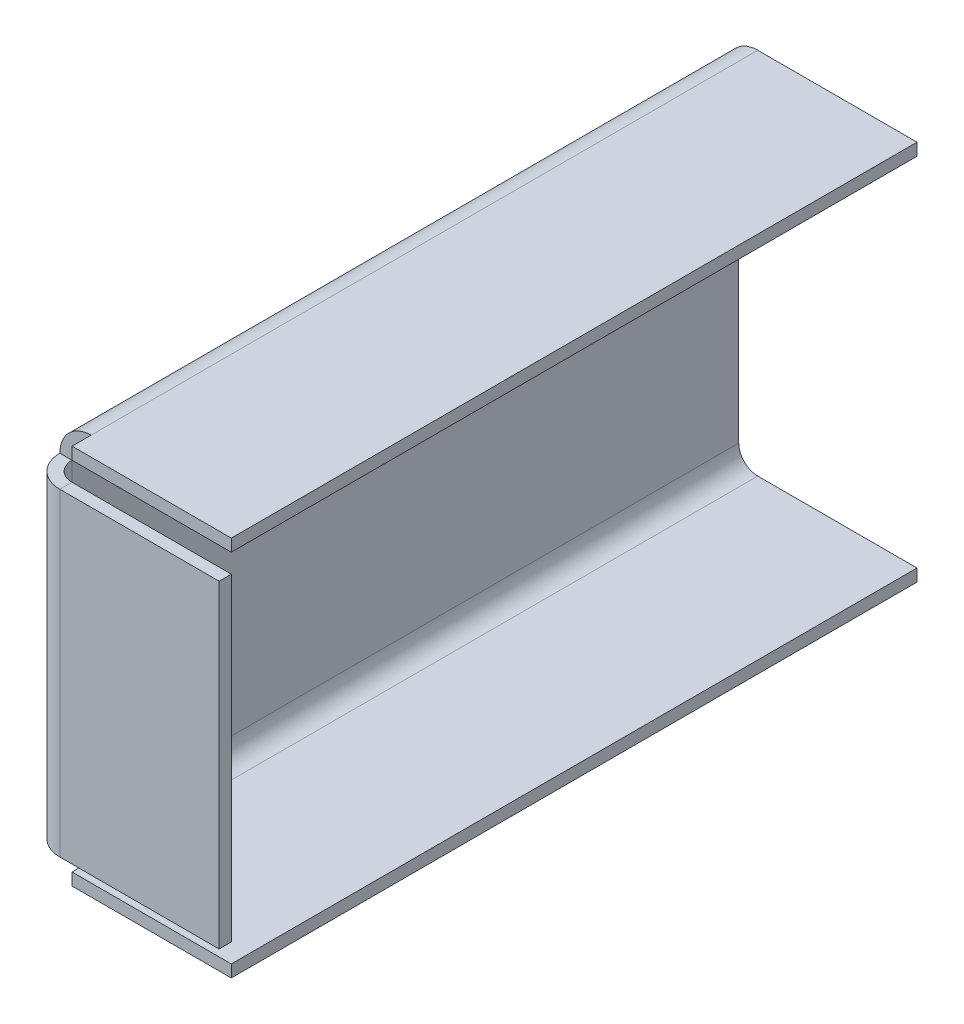
ISO-10303-21;
HEADER;
FILE_DESCRIPTION(('STEP AP214'),'2;1');
FILE_NAME('part.step','',(''),(''),'','','');
FILE_SCHEMA(('AUTOMOTIVE_DESIGN { 1 0 10303 214 1 1 1 1 }'));
ENDSEC;
DATA;
#1=APPLICATION_CONTEXT('core data for automotive mechanical design processes');
#2=APPLICATION_PROTOCOL_DEFINITION('international standard','automotive_design',2000,#1);
#3=PRODUCT_CONTEXT('',#1,'mechanical');
#4=PRODUCT('Part','Part','',(#3));
#5=PRODUCT_RELATED_PRODUCT_CATEGORY('part','',(#4));
#6=PRODUCT_DEFINITION_FORMATION('','',#4);
#7=PRODUCT_DEFINITION_CONTEXT('part definition',#1,'design');
#8=PRODUCT_DEFINITION('design','',#6,#7);
#9=PRODUCT_DEFINITION_SHAPE('','',#8);
#10=(LENGTH_UNIT() NAMED_UNIT(*) SI_UNIT(.MILLI.,.METRE.));
#11=(NAMED_UNIT(*) PLANE_ANGLE_UNIT() SI_UNIT($,.RADIAN.));
#12=(NAMED_UNIT(*) SI_UNIT($,.STERADIAN.) SOLID_ANGLE_UNIT());
#13=UNCERTAINTY_MEASURE_WITH_UNIT(LENGTH_MEASURE(1.E-05),#10,'distance_accuracy_value','');
#14=(GEOMETRIC_REPRESENTATION_CONTEXT(3) GLOBAL_UNCERTAINTY_ASSIGNED_CONTEXT((#13)) GLOBAL_UNIT_ASSIGNED_CONTEXT((#10,
#11,#12)) REPRESENTATION_CONTEXT('',''));
#15=CARTESIAN_POINT('',(0.,0.,0.));
#16=DIRECTION('',(0.,0.,1.));
#17=DIRECTION('',(1.,0.,0.));
#18=AXIS2_PLACEMENT_3D('',#15,#16,#17);
#19=CARTESIAN_POINT('',(3.17499999999998,0.,0.));
#20=DIRECTION('',(-1.,0.,0.));
#21=DIRECTION('',(0.,-1.,0.));
#22=AXIS2_PLACEMENT_3D('',#19,#20,#21);
#23=PLANE('',#22);
#24=DIRECTION('',(0.,1.,0.));
#25=VECTOR('',#24,1.);
#26=CARTESIAN_POINT('',(3.17499999999998,0.,-3.17499999999998));
#27=LINE('',#26,#25);
#28=CARTESIAN_POINT('',(3.17499999999998,0.,-3.17499999999998));
#29=VERTEX_POINT('',#28);
#30=CARTESIAN_POINT('',(3.17499999999999,2.03199999999999,-3.17499999999998));
#31=VERTEX_POINT('',#30);
#32=EDGE_CURVE('E13',#29,#31,#27,.T.);
#33=ORIENTED_EDGE('',*,*,#32,.F.);
#34=DIRECTION('',(0.,0.,-1.));
#35=VECTOR('',#34,1.);
#36=CARTESIAN_POINT('',(3.17499999999998,0.,0.));
#37=LINE('',#36,#35);
#38=CARTESIAN_POINT('',(3.17499999999998,0.,0.));
#39=VERTEX_POINT('',#38);
#40=EDGE_CURVE('E295',#29,#39,#37,.F.);
#41=ORIENTED_EDGE('',*,*,#40,.T.);
#42=DIRECTION('',(0.,1.,0.));
#43=VECTOR('',#42,1.);
#44=CARTESIAN_POINT('',(3.17499999999998,0.,0.));
#45=LINE('',#44,#43);
#46=CARTESIAN_POINT('',(3.17499999999999,2.03199999999999,0.));
#47=VERTEX_POINT('',#46);
#48=EDGE_CURVE('E268',#47,#39,#45,.F.);
#49=ORIENTED_EDGE('',*,*,#48,.F.);
#50=DIRECTION('',(0.,0.,-1.));
#51=VECTOR('',#50,1.);
#52=CARTESIAN_POINT('',(3.17499999999999,2.03199999999999,0.));
#53=LINE('',#52,#51);
#54=EDGE_CURVE('E299',#47,#31,#53,.T.);
#55=ORIENTED_EDGE('',*,*,#54,.T.);
#56=EDGE_LOOP('',(#33,#41,#49,#55));
#57=FACE_BOUND('',#56,.T.);
#58=ADVANCED_FACE('F85',(#57),#23,.T.);
#59=CARTESIAN_POINT('',(3.175,5.20699999999998,-114.3));
#60=DIRECTION('',(0.,0.,-1.));
#61=DIRECTION('',(0.,-1.,0.));
#62=AXIS2_PLACEMENT_3D('',#59,#60,#61);
#63=CYLINDRICAL_SURFACE('',#62,5.20700000000001);
#64=CARTESIAN_POINT('',(3.17499999999998,0.,-114.3));
#65=VERTEX_POINT('',#64);
#66=EDGE_CURVE('E292',#65,#29,#37,.F.);
#67=ORIENTED_EDGE('',*,*,#66,.T.);
#68=CARTESIAN_POINT('',(3.175,5.207,-3.17499999999998));
#69=DIRECTION('',(0.,0.,1.));
#70=DIRECTION('',(0.,-1.,0.));
#71=AXIS2_PLACEMENT_3D('',#68,#69,#70);
#72=CIRCLE('',#71,5.20700000000001);
#73=CARTESIAN_POINT('',(-2.03200000000001,5.207,-3.17499999999999));
#74=VERTEX_POINT('',#73);
#75=EDGE_CURVE('E378',#29,#74,#72,.F.);
#76=ORIENTED_EDGE('',*,*,#75,.T.);
#77=DIRECTION('',(0.,0.,-1.));
#78=VECTOR('',#77,1.);
#79=CARTESIAN_POINT('',(-2.03200000000001,5.20699999999999,-114.3));
#80=LINE('',#79,#78);
#81=CARTESIAN_POINT('',(-2.03200000000001,5.20699999999999,-114.3));
#82=VERTEX_POINT('',#81);
#83=EDGE_CURVE('E304',#82,#74,#80,.F.);
#84=ORIENTED_EDGE('',*,*,#83,.F.);
#85=CARTESIAN_POINT('',(3.175,5.20699999999998,-114.3));
#86=DIRECTION('',(0.,0.,-1.));
#87=DIRECTION('',(0.,1.,0.));
#88=AXIS2_PLACEMENT_3D('',#85,#86,#87);
#89=CIRCLE('',#88,5.20700000000001);
#90=EDGE_CURVE('E308',#65,#82,#89,.T.);
#91=ORIENTED_EDGE('',*,*,#90,.F.);
#92=EDGE_LOOP('',(#67,#76,#84,#91));
#93=FACE_BOUND('',#92,.T.);
#94=ADVANCED_FACE('F417',(#93),#63,.T.);
#95=CARTESIAN_POINT('',(3.17500000000019,0.,0.));
#96=DIRECTION('',(1.,0.,0.));
#97=DIRECTION('',(0.,1.,0.));
#98=AXIS2_PLACEMENT_3D('',#95,#96,#97);
#99=PLANE('',#98);
#100=DIRECTION('',(0.,1.,0.));
#101=VECTOR('',#100,1.);
#102=CARTESIAN_POINT('',(3.17499999999999,61.468,-3.175));
#103=LINE('',#102,#101);
#104=CARTESIAN_POINT('',(3.17499999999999,61.468,-3.175));
#105=VERTEX_POINT('',#104);
#106=CARTESIAN_POINT('',(3.17499999999998,63.5,-3.175));
#107=VERTEX_POINT('',#106);
#108=EDGE_CURVE('E376',#105,#107,#103,.T.);
#109=ORIENTED_EDGE('',*,*,#108,.F.);
#110=DIRECTION('',(0.,0.,1.));
#111=VECTOR('',#110,1.);
#112=CARTESIAN_POINT('',(3.17499999999999,61.468,-114.3));
#113=LINE('',#112,#111);
#114=CARTESIAN_POINT('',(3.17499999999999,61.468,0.));
#115=VERTEX_POINT('',#114);
#116=EDGE_CURVE('E349',#105,#115,#113,.T.);
#117=ORIENTED_EDGE('',*,*,#116,.T.);
#118=DIRECTION('',(0.,-1.,0.));
#119=VECTOR('',#118,1.);
#120=CARTESIAN_POINT('',(3.17499999999999,61.468,0.));
#121=LINE('',#120,#119);
#122=CARTESIAN_POINT('',(3.17499999999998,63.5,0.));
#123=VERTEX_POINT('',#122);
#124=EDGE_CURVE('E344',#115,#123,#121,.F.);
#125=ORIENTED_EDGE('',*,*,#124,.T.);
#126=DIRECTION('',(0.,0.,1.));
#127=VECTOR('',#126,1.);
#128=CARTESIAN_POINT('',(3.17499999999998,63.5,-114.3));
#129=LINE('',#128,#127);
#130=EDGE_CURVE('E340',#123,#107,#129,.F.);
#131=ORIENTED_EDGE('',*,*,#130,.T.);
#132=EDGE_LOOP('',(#109,#117,#125,#131));
#133=FACE_BOUND('',#132,.T.);
#134=ADVANCED_FACE('F456',(#133),#99,.F.);
#135=CARTESIAN_POINT('',(3.175,58.293,0.));
#136=DIRECTION('',(0.,0.,1.));
#137=DIRECTION('',(0.,1.,0.));
#138=AXIS2_PLACEMENT_3D('',#135,#136,#137);
#139=CYLINDRICAL_SURFACE('',#138,5.207);
#140=DIRECTION('',(0.,0.,1.));
#141=VECTOR('',#140,1.);
#142=CARTESIAN_POINT('',(-2.032,58.293,0.));
#143=LINE('',#142,#141);
#144=CARTESIAN_POINT('',(-2.032,58.293,-3.17499999999999));
#145=VERTEX_POINT('',#144);
#146=CARTESIAN_POINT('',(-2.032,58.293,-114.3));
#147=VERTEX_POINT('',#146);
#148=EDGE_CURVE('E352',#145,#147,#143,.F.);
#149=ORIENTED_EDGE('',*,*,#148,.F.);
#150=CARTESIAN_POINT('',(3.175,58.293,-3.17499999999999));
#151=DIRECTION('',(0.,0.,1.));
#152=DIRECTION('',(0.,-1.,0.));
#153=AXIS2_PLACEMENT_3D('',#150,#151,#152);
#154=CIRCLE('',#153,5.207);
#155=EDGE_CURVE('E373',#145,#107,#154,.F.);
#156=ORIENTED_EDGE('',*,*,#155,.T.);
#157=CARTESIAN_POINT('',(3.17499999999998,63.5,-114.3));
#158=VERTEX_POINT('',#157);
#159=EDGE_CURVE('E343',#107,#158,#129,.F.);
#160=ORIENTED_EDGE('',*,*,#159,.T.);
#161=CARTESIAN_POINT('',(3.175,58.293,-114.3));
#162=DIRECTION('',(0.,0.,1.));
#163=DIRECTION('',(1.,0.,0.));
#164=AXIS2_PLACEMENT_3D('',#161,#162,#163);
#165=CIRCLE('',#164,5.207);
#166=EDGE_CURVE('E354',#147,#158,#165,.F.);
#167=ORIENTED_EDGE('',*,*,#166,.F.);
#168=EDGE_LOOP('',(#149,#156,#160,#167));
#169=FACE_BOUND('',#168,.T.);
#170=ADVANCED_FACE('F427',(#169),#139,.T.);
#171=CARTESIAN_POINT('',(3.175,58.293,-3.17499999999999));
#172=DIRECTION('',(0.,0.,1.));
#173=DIRECTION('',(0.,-1.,0.));
#174=AXIS2_PLACEMENT_3D('',#171,#172,#173);
#175=PLANE('',#174);
#176=CARTESIAN_POINT('',(3.175,58.293,-3.17499999999999));
#177=DIRECTION('',(0.,0.,1.));
#178=DIRECTION('',(0.,-1.,0.));
#179=AXIS2_PLACEMENT_3D('',#176,#177,#178);
#180=CIRCLE('',#179,3.175);
#181=CARTESIAN_POINT('',(0.,58.293,-3.17499999999999));
#182=VERTEX_POINT('',#181);
#183=EDGE_CURVE('E368',#182,#105,#180,.F.);
#184=ORIENTED_EDGE('',*,*,#183,.T.);
#185=ORIENTED_EDGE('',*,*,#108,.T.);
#186=ORIENTED_EDGE('',*,*,#155,.F.);
#187=DIRECTION('',(-1.,0.,0.));
#188=VECTOR('',#187,1.);
#189=CARTESIAN_POINT('',(0.,58.293,-3.17499999999999));
#190=LINE('',#189,#188);
#191=EDGE_CURVE('E265',#182,#145,#190,.T.);
#192=ORIENTED_EDGE('',*,*,#191,.F.);
#193=EDGE_LOOP('',(#184,#185,#186,#192));
#194=FACE_BOUND('',#193,.T.);
#195=ADVANCED_FACE('F494',(#194),#175,.T.);
#196=CARTESIAN_POINT('',(-2.032,0.,0.));
#197=DIRECTION('',(-1.,0.,0.));
#198=DIRECTION('',(0.,0.,1.));
#199=AXIS2_PLACEMENT_3D('',#196,#197,#198);
#200=PLANE('',#199);
#201=ORIENTED_EDGE('',*,*,#83,.T.);
#202=DIRECTION('',(0.,-1.,0.));
#203=VECTOR('',#202,1.);
#204=CARTESIAN_POINT('',(-2.03200000000001,5.20700000000001,-3.17499999999999));
#205=LINE('',#204,#203);
#206=EDGE_CURVE('E212',#74,#145,#205,.F.);
#207=ORIENTED_EDGE('',*,*,#206,.T.);
#208=ORIENTED_EDGE('',*,*,#148,.T.);
#209=DIRECTION('',(0.,1.,0.));
#210=VECTOR('',#209,1.);
#211=CARTESIAN_POINT('',(-2.032,0.,-114.3));
#212=LINE('',#211,#210);
#213=EDGE_CURVE('E365',#82,#147,#212,.T.);
#214=ORIENTED_EDGE('',*,*,#213,.F.);
#215=EDGE_LOOP('',(#201,#207,#208,#214));
#216=FACE_BOUND('',#215,.T.);
#217=ADVANCED_FACE('F423',(#216),#200,.T.);
#218=CARTESIAN_POINT('',(0.,0.,0.));
#219=DIRECTION('',(-1.,0.,0.));
#220=DIRECTION('',(0.,0.,1.));
#221=AXIS2_PLACEMENT_3D('',#218,#219,#220);
#222=PLANE('',#221);
#223=DIRECTION('',(0.,-1.,0.));
#224=VECTOR('',#223,1.);
#225=CARTESIAN_POINT('',(0.,5.207,-3.17499999999999));
#226=LINE('',#225,#224);
#227=CARTESIAN_POINT('',(0.,5.207,-3.17499999999999));
#228=VERTEX_POINT('',#227);
#229=EDGE_CURVE('E262',#228,#182,#226,.F.);
#230=ORIENTED_EDGE('',*,*,#229,.F.);
#231=DIRECTION('',(0.,0.,-1.));
#232=VECTOR('',#231,1.);
#233=CARTESIAN_POINT('',(0.,5.20699999999999,-114.3));
#234=LINE('',#233,#232);
#235=CARTESIAN_POINT('',(0.,5.20699999999999,-114.3));
#236=VERTEX_POINT('',#235);
#237=EDGE_CURVE('E311',#236,#228,#234,.F.);
#238=ORIENTED_EDGE('',*,*,#237,.F.);
#239=DIRECTION('',(0.,1.,0.));
#240=VECTOR('',#239,1.);
#241=CARTESIAN_POINT('',(0.,0.,-114.3));
#242=LINE('',#241,#240);
#243=CARTESIAN_POINT('',(0.,58.293,-114.3));
#244=VERTEX_POINT('',#243);
#245=EDGE_CURVE('E364',#236,#244,#242,.T.);
#246=ORIENTED_EDGE('',*,*,#245,.T.);
#247=DIRECTION('',(0.,0.,1.));
#248=VECTOR('',#247,1.);
#249=CARTESIAN_POINT('',(0.,58.293,0.));
#250=LINE('',#249,#248);
#251=EDGE_CURVE('E322',#182,#244,#250,.F.);
#252=ORIENTED_EDGE('',*,*,#251,.F.);
#253=EDGE_LOOP('',(#230,#238,#246,#252));
#254=FACE_BOUND('',#253,.T.);
#255=ADVANCED_FACE('F386',(#254),#222,.F.);
#256=CARTESIAN_POINT('',(-2.032,0.,-114.3));
#257=DIRECTION('',(0.,0.,-1.));
#258=DIRECTION('',(-1.,0.,0.));
#259=AXIS2_PLACEMENT_3D('',#256,#257,#258);
#260=PLANE('',#259);
#261=ORIENTED_EDGE('',*,*,#245,.F.);
#262=DIRECTION('',(-1.,0.,0.));
#263=VECTOR('',#262,1.);
#264=CARTESIAN_POINT('',(0.,5.20699999999999,-114.3));
#265=LINE('',#264,#263);
#266=EDGE_CURVE('E307',#236,#82,#265,.T.);
#267=ORIENTED_EDGE('',*,*,#266,.T.);
#268=ORIENTED_EDGE('',*,*,#213,.T.);
#269=DIRECTION('',(-1.,0.,0.));
#270=VECTOR('',#269,1.);
#271=CARTESIAN_POINT('',(0.,58.293,-114.3));
#272=LINE('',#271,#270);
#273=EDGE_CURVE('E358',#244,#147,#272,.T.);
#274=ORIENTED_EDGE('',*,*,#273,.F.);
#275=EDGE_LOOP('',(#261,#267,#268,#274));
#276=FACE_BOUND('',#275,.T.);
#277=ADVANCED_FACE('F420',(#276),#260,.T.);
#278=CARTESIAN_POINT('',(3.175,58.293,-114.3));
#279=DIRECTION('',(0.,0.,-1.));
#280=DIRECTION('',(-1.,0.,0.));
#281=AXIS2_PLACEMENT_3D('',#278,#279,#280);
#282=PLANE('',#281);
#283=DIRECTION('',(0.,-1.,0.));
#284=VECTOR('',#283,1.);
#285=CARTESIAN_POINT('',(3.17499999999998,63.5,-114.3));
#286=LINE('',#285,#284);
#287=CARTESIAN_POINT('',(3.17499999999999,61.468,-114.3));
#288=VERTEX_POINT('',#287);
#289=EDGE_CURVE('E318',#288,#158,#286,.F.);
#290=ORIENTED_EDGE('',*,*,#289,.F.);
#291=CARTESIAN_POINT('',(3.175,58.293,-114.3));
#292=DIRECTION('',(0.,0.,1.));
#293=DIRECTION('',(1.,0.,0.));
#294=AXIS2_PLACEMENT_3D('',#291,#292,#293);
#295=CIRCLE('',#294,3.175);
#296=EDGE_CURVE('E355',#244,#288,#295,.F.);
#297=ORIENTED_EDGE('',*,*,#296,.F.);
#298=ORIENTED_EDGE('',*,*,#273,.T.);
#299=ORIENTED_EDGE('',*,*,#166,.T.);
#300=EDGE_LOOP('',(#290,#297,#298,#299));
#301=FACE_BOUND('',#300,.T.);
#302=ADVANCED_FACE('F431',(#301),#282,.T.);
#303=CARTESIAN_POINT('',(3.175,58.293,0.));
#304=DIRECTION('',(0.,0.,1.));
#305=DIRECTION('',(0.,1.,0.));
#306=AXIS2_PLACEMENT_3D('',#303,#304,#305);
#307=CYLINDRICAL_SURFACE('',#306,3.175);
#308=ORIENTED_EDGE('',*,*,#183,.F.);
#309=ORIENTED_EDGE('',*,*,#251,.T.);
#310=ORIENTED_EDGE('',*,*,#296,.T.);
#311=EDGE_CURVE('E346',#288,#105,#113,.T.);
#312=ORIENTED_EDGE('',*,*,#311,.T.);
#313=EDGE_LOOP('',(#308,#309,#310,#312));
#314=FACE_BOUND('',#313,.T.);
#315=ADVANCED_FACE('F435',(#314),#307,.F.);
#316=CARTESIAN_POINT('',(0.,63.5,-114.3));
#317=DIRECTION('',(0.,0.,1.));
#318=DIRECTION('',(1.,0.,0.));
#319=AXIS2_PLACEMENT_3D('',#316,#317,#318);
#320=PLANE('',#319);
#321=ORIENTED_EDGE('',*,*,#289,.T.);
#322=DIRECTION('',(-1.,0.,0.));
#323=VECTOR('',#322,1.);
#324=CARTESIAN_POINT('',(-2.14668439342711E-13,63.5,-114.3));
#325=LINE('',#324,#323);
#326=CARTESIAN_POINT('',(29.718,63.5000000000001,-114.3));
#327=VERTEX_POINT('',#326);
#328=EDGE_CURVE('E330',#327,#158,#325,.T.);
#329=ORIENTED_EDGE('',*,*,#328,.F.);
#330=DIRECTION('',(0.,-1.,0.));
#331=VECTOR('',#330,1.);
#332=CARTESIAN_POINT('',(29.718,63.5000000000001,-114.3));
#333=LINE('',#332,#331);
#334=CARTESIAN_POINT('',(29.718,61.4680000000001,-114.3));
#335=VERTEX_POINT('',#334);
#336=EDGE_CURVE('E323',#327,#335,#333,.T.);
#337=ORIENTED_EDGE('',*,*,#336,.T.);
#338=DIRECTION('',(1.,0.,0.));
#339=VECTOR('',#338,1.);
#340=CARTESIAN_POINT('',(0.,61.468,-114.3));
#341=LINE('',#340,#339);
#342=EDGE_CURVE('E337',#335,#288,#341,.F.);
#343=ORIENTED_EDGE('',*,*,#342,.T.);
#344=EDGE_LOOP('',(#321,#329,#337,#343));
#345=FACE_BOUND('',#344,.T.);
#346=ADVANCED_FACE('F443',(#345),#320,.F.);
#347=CARTESIAN_POINT('',(29.718,63.5000000000001,0.));
#348=DIRECTION('',(0.,0.,-1.));
#349=DIRECTION('',(-1.,0.,0.));
#350=AXIS2_PLACEMENT_3D('',#347,#348,#349);
#351=PLANE('',#350);
#352=ORIENTED_EDGE('',*,*,#124,.F.);
#353=DIRECTION('',(-1.,0.,0.));
#354=VECTOR('',#353,1.);
#355=CARTESIAN_POINT('',(29.718,61.4680000000001,0.));
#356=LINE('',#355,#354);
#357=CARTESIAN_POINT('',(29.718,61.4680000000001,0.));
#358=VERTEX_POINT('',#357);
#359=EDGE_CURVE('E335',#115,#358,#356,.F.);
#360=ORIENTED_EDGE('',*,*,#359,.T.);
#361=DIRECTION('',(0.,-1.,0.));
#362=VECTOR('',#361,1.);
#363=CARTESIAN_POINT('',(29.718,63.5000000000001,0.));
#364=LINE('',#363,#362);
#365=CARTESIAN_POINT('',(29.718,63.5000000000001,0.));
#366=VERTEX_POINT('',#365);
#367=EDGE_CURVE('E319',#366,#358,#364,.T.);
#368=ORIENTED_EDGE('',*,*,#367,.F.);
#369=DIRECTION('',(1.,0.,0.));
#370=VECTOR('',#369,1.);
#371=CARTESIAN_POINT('',(-2.14668439342711E-13,63.5,0.));
#372=LINE('',#371,#370);
#373=EDGE_CURVE('E328',#123,#366,#372,.T.);
#374=ORIENTED_EDGE('',*,*,#373,.F.);
#375=EDGE_LOOP('',(#352,#360,#368,#374));
#376=FACE_BOUND('',#375,.T.);
#377=ADVANCED_FACE('F452',(#376),#351,.F.);
#378=CARTESIAN_POINT('',(-2.14668439342711E-13,63.5,0.));
#379=DIRECTION('',(0.,-1.,0.));
#380=DIRECTION('',(1.,0.,0.));
#381=AXIS2_PLACEMENT_3D('',#378,#379,#380);
#382=PLANE('',#381);
#383=ORIENTED_EDGE('',*,*,#130,.F.);
#384=ORIENTED_EDGE('',*,*,#373,.T.);
#385=DIRECTION('',(0.,0.,-1.));
#386=VECTOR('',#385,1.);
#387=CARTESIAN_POINT('',(29.718,63.5000000000001,0.));
#388=LINE('',#387,#386);
#389=EDGE_CURVE('E326',#366,#327,#388,.T.);
#390=ORIENTED_EDGE('',*,*,#389,.T.);
#391=ORIENTED_EDGE('',*,*,#328,.T.);
#392=ORIENTED_EDGE('',*,*,#159,.F.);
#393=EDGE_LOOP('',(#383,#384,#390,#391,#392));
#394=FACE_BOUND('',#393,.T.);
#395=ADVANCED_FACE('F458',(#394),#382,.F.);
#396=CARTESIAN_POINT('',(-2.07573749262182E-13,61.468,0.));
#397=DIRECTION('',(0.,-1.,0.));
#398=DIRECTION('',(1.,0.,0.));
#399=AXIS2_PLACEMENT_3D('',#396,#397,#398);
#400=PLANE('',#399);
#401=ORIENTED_EDGE('',*,*,#359,.F.);
#402=ORIENTED_EDGE('',*,*,#116,.F.);
#403=ORIENTED_EDGE('',*,*,#311,.F.);
#404=ORIENTED_EDGE('',*,*,#342,.F.);
#405=DIRECTION('',(0.,0.,1.));
#406=VECTOR('',#405,1.);
#407=CARTESIAN_POINT('',(29.718,61.4680000000001,-114.3));
#408=LINE('',#407,#406);
#409=EDGE_CURVE('E333',#358,#335,#408,.F.);
#410=ORIENTED_EDGE('',*,*,#409,.F.);
#411=EDGE_LOOP('',(#401,#402,#403,#404,#410));
#412=FACE_BOUND('',#411,.T.);
#413=ADVANCED_FACE('F440',(#412),#400,.T.);
#414=CARTESIAN_POINT('',(29.718,63.5000000000001,-114.3));
#415=DIRECTION('',(-1.,0.,0.));
#416=DIRECTION('',(0.,-1.,0.));
#417=AXIS2_PLACEMENT_3D('',#414,#415,#416);
#418=PLANE('',#417);
#419=ORIENTED_EDGE('',*,*,#409,.T.);
#420=ORIENTED_EDGE('',*,*,#336,.F.);
#421=ORIENTED_EDGE('',*,*,#389,.F.);
#422=ORIENTED_EDGE('',*,*,#367,.T.);
#423=EDGE_LOOP('',(#419,#420,#421,#422));
#424=FACE_BOUND('',#423,.T.);
#425=ADVANCED_FACE('F448',(#424),#418,.F.);
#426=CARTESIAN_POINT('',(3.175,5.20699999999998,-114.3));
#427=DIRECTION('',(0.,0.,1.));
#428=DIRECTION('',(0.,-1.,0.));
#429=AXIS2_PLACEMENT_3D('',#426,#427,#428);
#430=PLANE('',#429);
#431=CARTESIAN_POINT('',(3.175,5.20699999999998,-114.3));
#432=DIRECTION('',(0.,0.,-1.));
#433=DIRECTION('',(0.,1.,0.));
#434=AXIS2_PLACEMENT_3D('',#431,#432,#433);
#435=CIRCLE('',#434,3.17500000000001);
#436=CARTESIAN_POINT('',(3.17499999999999,2.03199999999997,-114.3));
#437=VERTEX_POINT('',#436);
#438=EDGE_CURVE('E274',#437,#236,#435,.T.);
#439=ORIENTED_EDGE('',*,*,#438,.F.);
#440=DIRECTION('',(0.,1.,0.));
#441=VECTOR('',#440,1.);
#442=CARTESIAN_POINT('',(3.17499999999999,2.03199999999999,-114.3));
#443=LINE('',#442,#441);
#444=EDGE_CURVE('E296',#437,#65,#443,.F.);
#445=ORIENTED_EDGE('',*,*,#444,.T.);
#446=ORIENTED_EDGE('',*,*,#90,.T.);
#447=ORIENTED_EDGE('',*,*,#266,.F.);
#448=EDGE_LOOP('',(#439,#445,#446,#447));
#449=FACE_BOUND('',#448,.T.);
#450=ADVANCED_FACE('F394',(#449),#430,.F.);
#451=CARTESIAN_POINT('',(3.175,5.207,-3.17499999999998));
#452=DIRECTION('',(0.,0.,1.));
#453=DIRECTION('',(0.,-1.,0.));
#454=AXIS2_PLACEMENT_3D('',#451,#452,#453);
#455=PLANE('',#454);
#456=ORIENTED_EDGE('',*,*,#75,.F.);
#457=ORIENTED_EDGE('',*,*,#32,.T.);
#458=CARTESIAN_POINT('',(3.175,5.207,-3.17499999999998));
#459=DIRECTION('',(0.,0.,1.));
#460=DIRECTION('',(0.,-1.,0.));
#461=AXIS2_PLACEMENT_3D('',#458,#459,#460);
#462=CIRCLE('',#461,3.17500000000001);
#463=EDGE_CURVE('E92',#31,#228,#462,.F.);
#464=ORIENTED_EDGE('',*,*,#463,.T.);
#465=DIRECTION('',(-1.,0.,0.));
#466=VECTOR('',#465,1.);
#467=CARTESIAN_POINT('',(0.,5.207,-3.17499999999999));
#468=LINE('',#467,#466);
#469=EDGE_CURVE('E258',#228,#74,#468,.T.);
#470=ORIENTED_EDGE('',*,*,#469,.T.);
#471=EDGE_LOOP('',(#456,#457,#464,#470));
#472=FACE_BOUND('',#471,.T.);
#473=ADVANCED_FACE('F380',(#472),#455,.T.);
#474=CARTESIAN_POINT('',(3.175,5.20699999999998,-114.3));
#475=DIRECTION('',(0.,0.,-1.));
#476=DIRECTION('',(0.,-1.,0.));
#477=AXIS2_PLACEMENT_3D('',#474,#475,#476);
#478=CYLINDRICAL_SURFACE('',#477,3.17500000000001);
#479=ORIENTED_EDGE('',*,*,#463,.F.);
#480=EDGE_CURVE('E301',#31,#437,#53,.T.);
#481=ORIENTED_EDGE('',*,*,#480,.T.);
#482=ORIENTED_EDGE('',*,*,#438,.T.);
#483=ORIENTED_EDGE('',*,*,#237,.T.);
#484=EDGE_LOOP('',(#479,#481,#482,#483));
#485=FACE_BOUND('',#484,.T.);
#486=ADVANCED_FACE('F390',(#485),#478,.F.);
#487=CARTESIAN_POINT('',(0.,0.,0.));
#488=DIRECTION('',(0.,0.,-1.));
#489=DIRECTION('',(-1.,0.,0.));
#490=AXIS2_PLACEMENT_3D('',#487,#488,#489);
#491=PLANE('',#490);
#492=ORIENTED_EDGE('',*,*,#48,.T.);
#493=DIRECTION('',(-1.,0.,0.));
#494=VECTOR('',#493,1.);
#495=CARTESIAN_POINT('',(0.,0.,0.));
#496=LINE('',#495,#494);
#497=CARTESIAN_POINT('',(29.718,-1.0375984242774E-13,0.));
#498=VERTEX_POINT('',#497);
#499=EDGE_CURVE('E282',#498,#39,#496,.T.);
#500=ORIENTED_EDGE('',*,*,#499,.F.);
#501=DIRECTION('',(0.,1.,0.));
#502=VECTOR('',#501,1.);
#503=CARTESIAN_POINT('',(29.718,-1.0375984242774E-13,0.));
#504=LINE('',#503,#502);
#505=CARTESIAN_POINT('',(29.718,2.0319999999999,0.));
#506=VERTEX_POINT('',#505);
#507=EDGE_CURVE('E275',#498,#506,#504,.T.);
#508=ORIENTED_EDGE('',*,*,#507,.T.);
#509=DIRECTION('',(1.,0.,0.));
#510=VECTOR('',#509,1.);
#511=CARTESIAN_POINT('',(0.,2.032,0.));
#512=LINE('',#511,#510);
#513=EDGE_CURVE('E289',#506,#47,#512,.F.);
#514=ORIENTED_EDGE('',*,*,#513,.T.);
#515=EDGE_LOOP('',(#492,#500,#508,#514));
#516=FACE_BOUND('',#515,.T.);
#517=ADVANCED_FACE('F412',(#516),#491,.F.);
#518=CARTESIAN_POINT('',(29.718,-1.03649727689614E-13,-114.3));
#519=DIRECTION('',(0.,0.,1.));
#520=DIRECTION('',(1.,0.,0.));
#521=AXIS2_PLACEMENT_3D('',#518,#519,#520);
#522=PLANE('',#521);
#523=ORIENTED_EDGE('',*,*,#444,.F.);
#524=DIRECTION('',(-1.,0.,0.));
#525=VECTOR('',#524,1.);
#526=CARTESIAN_POINT('',(29.718,2.0319999999999,-114.3));
#527=LINE('',#526,#525);
#528=CARTESIAN_POINT('',(29.718,2.0319999999999,-114.3));
#529=VERTEX_POINT('',#528);
#530=EDGE_CURVE('E287',#437,#529,#527,.F.);
#531=ORIENTED_EDGE('',*,*,#530,.T.);
#532=DIRECTION('',(0.,1.,0.));
#533=VECTOR('',#532,1.);
#534=CARTESIAN_POINT('',(29.718,-1.03649727689614E-13,-114.3));
#535=LINE('',#534,#533);
#536=CARTESIAN_POINT('',(29.718,-1.0375984242774E-13,-114.3));
#537=VERTEX_POINT('',#536);
#538=EDGE_CURVE('E271',#537,#529,#535,.T.);
#539=ORIENTED_EDGE('',*,*,#538,.F.);
#540=DIRECTION('',(1.,0.,0.));
#541=VECTOR('',#540,1.);
#542=CARTESIAN_POINT('',(0.,0.,-114.3));
#543=LINE('',#542,#541);
#544=EDGE_CURVE('E280',#65,#537,#543,.T.);
#545=ORIENTED_EDGE('',*,*,#544,.F.);
#546=EDGE_LOOP('',(#523,#531,#539,#545));
#547=FACE_BOUND('',#546,.T.);
#548=ADVANCED_FACE('F399',(#547),#522,.F.);
#549=CARTESIAN_POINT('',(0.,0.,0.));
#550=DIRECTION('',(0.,1.,0.));
#551=DIRECTION('',(-1.,0.,0.));
#552=AXIS2_PLACEMENT_3D('',#549,#550,#551);
#553=PLANE('',#552);
#554=ORIENTED_EDGE('',*,*,#66,.F.);
#555=ORIENTED_EDGE('',*,*,#544,.T.);
#556=DIRECTION('',(0.,0.,1.));
#557=VECTOR('',#556,1.);
#558=CARTESIAN_POINT('',(29.718,-1.0375984242774E-13,0.));
#559=LINE('',#558,#557);
#560=EDGE_CURVE('E278',#537,#498,#559,.T.);
#561=ORIENTED_EDGE('',*,*,#560,.T.);
#562=ORIENTED_EDGE('',*,*,#499,.T.);
#563=ORIENTED_EDGE('',*,*,#40,.F.);
#564=EDGE_LOOP('',(#554,#555,#561,#562,#563));
#565=FACE_BOUND('',#564,.T.);
#566=ADVANCED_FACE('F415',(#565),#553,.F.);
#567=CARTESIAN_POINT('',(0.,2.032,0.));
#568=DIRECTION('',(0.,1.,0.));
#569=DIRECTION('',(-1.,0.,0.));
#570=AXIS2_PLACEMENT_3D('',#567,#568,#569);
#571=PLANE('',#570);
#572=ORIENTED_EDGE('',*,*,#530,.F.);
#573=ORIENTED_EDGE('',*,*,#480,.F.);
#574=ORIENTED_EDGE('',*,*,#54,.F.);
#575=ORIENTED_EDGE('',*,*,#513,.F.);
#576=DIRECTION('',(0.,0.,-1.));
#577=VECTOR('',#576,1.);
#578=CARTESIAN_POINT('',(29.718,2.0319999999999,0.));
#579=LINE('',#578,#577);
#580=EDGE_CURVE('E285',#529,#506,#579,.F.);
#581=ORIENTED_EDGE('',*,*,#580,.F.);
#582=EDGE_LOOP('',(#572,#573,#574,#575,#581));
#583=FACE_BOUND('',#582,.T.);
#584=ADVANCED_FACE('F403',(#583),#571,.T.);
#585=CARTESIAN_POINT('',(29.718,-1.03649727689614E-13,0.));
#586=DIRECTION('',(-1.,0.,0.));
#587=DIRECTION('',(0.,-1.,0.));
#588=AXIS2_PLACEMENT_3D('',#585,#586,#587);
#589=PLANE('',#588);
#590=ORIENTED_EDGE('',*,*,#580,.T.);
#591=ORIENTED_EDGE('',*,*,#507,.F.);
#592=ORIENTED_EDGE('',*,*,#560,.F.);
#593=ORIENTED_EDGE('',*,*,#538,.T.);
#594=EDGE_LOOP('',(#590,#591,#592,#593));
#595=FACE_BOUND('',#594,.T.);
#596=ADVANCED_FACE('F408',(#595),#589,.F.);
#597=CARTESIAN_POINT('',(3.175,58.293,-3.17499999999999));
#598=DIRECTION('',(0.,1.,0.));
#599=DIRECTION('',(-1.,0.,0.));
#600=AXIS2_PLACEMENT_3D('',#597,#598,#599);
#601=PLANE('',#600);
#602=DIRECTION('',(0.,0.,1.));
#603=VECTOR('',#602,1.);
#604=CARTESIAN_POINT('',(3.175,58.293,0.));
#605=LINE('',#604,#603);
#606=CARTESIAN_POINT('',(3.17499999999999,58.293,0.));
#607=VERTEX_POINT('',#606);
#608=CARTESIAN_POINT('',(3.17499999999998,58.293,2.03200000000001));
#609=VERTEX_POINT('',#608);
#610=EDGE_CURVE('E514',#607,#609,#605,.T.);
#611=ORIENTED_EDGE('',*,*,#610,.F.);
#612=CARTESIAN_POINT('',(3.175,58.293,-3.17499999999999));
#613=DIRECTION('',(0.,-1.,0.));
#614=DIRECTION('',(1.,0.,0.));
#615=AXIS2_PLACEMENT_3D('',#612,#613,#614);
#616=CIRCLE('',#615,3.175);
#617=EDGE_CURVE('E215',#182,#607,#616,.F.);
#618=ORIENTED_EDGE('',*,*,#617,.F.);
#619=ORIENTED_EDGE('',*,*,#191,.T.);
#620=CARTESIAN_POINT('',(3.175,58.293,-3.17499999999999));
#621=DIRECTION('',(0.,-1.,0.));
#622=DIRECTION('',(1.,0.,0.));
#623=AXIS2_PLACEMENT_3D('',#620,#621,#622);
#624=CIRCLE('',#623,5.207);
#625=EDGE_CURVE('E257',#145,#609,#624,.F.);
#626=ORIENTED_EDGE('',*,*,#625,.T.);
#627=EDGE_LOOP('',(#611,#618,#619,#626));
#628=FACE_BOUND('',#627,.T.);
#629=ADVANCED_FACE('F512',(#628),#601,.T.);
#630=CARTESIAN_POINT('',(3.17499999999999,5.207,-3.17499999999998));
#631=DIRECTION('',(0.,1.,0.));
#632=DIRECTION('',(-1.,0.,0.));
#633=AXIS2_PLACEMENT_3D('',#630,#631,#632);
#634=PLANE('',#633);
#635=CARTESIAN_POINT('',(3.17499999999999,5.207,-3.17499999999998));
#636=DIRECTION('',(0.,-1.,0.));
#637=DIRECTION('',(1.,0.,0.));
#638=AXIS2_PLACEMENT_3D('',#635,#636,#637);
#639=CIRCLE('',#638,3.175);
#640=CARTESIAN_POINT('',(3.17499999999998,5.207,0.));
#641=VERTEX_POINT('',#640);
#642=EDGE_CURVE('E222',#641,#228,#639,.T.);
#643=ORIENTED_EDGE('',*,*,#642,.F.);
#644=DIRECTION('',(0.,0.,1.));
#645=VECTOR('',#644,1.);
#646=CARTESIAN_POINT('',(3.17499999999999,5.207,0.));
#647=LINE('',#646,#645);
#648=CARTESIAN_POINT('',(3.17499999999999,5.207,2.03200000000001));
#649=VERTEX_POINT('',#648);
#650=EDGE_CURVE('E219',#641,#649,#647,.T.);
#651=ORIENTED_EDGE('',*,*,#650,.T.);
#652=CARTESIAN_POINT('',(3.17499999999999,5.207,-3.17499999999998));
#653=DIRECTION('',(0.,-1.,0.));
#654=DIRECTION('',(1.,0.,0.));
#655=AXIS2_PLACEMENT_3D('',#652,#653,#654);
#656=CIRCLE('',#655,5.207);
#657=EDGE_CURVE('E205',#649,#74,#656,.T.);
#658=ORIENTED_EDGE('',*,*,#657,.T.);
#659=ORIENTED_EDGE('',*,*,#469,.F.);
#660=EDGE_LOOP('',(#643,#651,#658,#659));
#661=FACE_BOUND('',#660,.T.);
#662=ADVANCED_FACE('F220',(#661),#634,.F.);
#663=CARTESIAN_POINT('',(3.17499999999999,5.207,-3.17499999999998));
#664=DIRECTION('',(0.,-1.,0.));
#665=DIRECTION('',(0.,0.,1.));
#666=AXIS2_PLACEMENT_3D('',#663,#664,#665);
#667=CYLINDRICAL_SURFACE('',#666,5.207);
#668=ORIENTED_EDGE('',*,*,#206,.F.);
#669=ORIENTED_EDGE('',*,*,#657,.F.);
#670=DIRECTION('',(0.,1.,0.));
#671=VECTOR('',#670,1.);
#672=CARTESIAN_POINT('',(3.17499999999999,0.,2.03200000000001));
#673=LINE('',#672,#671);
#674=EDGE_CURVE('E209',#649,#609,#673,.T.);
#675=ORIENTED_EDGE('',*,*,#674,.T.);
#676=ORIENTED_EDGE('',*,*,#625,.F.);
#677=EDGE_LOOP('',(#668,#669,#675,#676));
#678=FACE_BOUND('',#677,.T.);
#679=ADVANCED_FACE('F207',(#678),#667,.T.);
#680=CARTESIAN_POINT('',(3.17499999999999,5.207,-3.17499999999998));
#681=DIRECTION('',(0.,-1.,0.));
#682=DIRECTION('',(0.,0.,1.));
#683=AXIS2_PLACEMENT_3D('',#680,#681,#682);
#684=CYLINDRICAL_SURFACE('',#683,3.175);
#685=ORIENTED_EDGE('',*,*,#229,.T.);
#686=ORIENTED_EDGE('',*,*,#617,.T.);
#687=DIRECTION('',(0.,-1.,0.));
#688=VECTOR('',#687,1.);
#689=CARTESIAN_POINT('',(3.175,58.293,0.));
#690=LINE('',#689,#688);
#691=EDGE_CURVE('E226',#607,#641,#690,.T.);
#692=ORIENTED_EDGE('',*,*,#691,.T.);
#693=ORIENTED_EDGE('',*,*,#642,.T.);
#694=EDGE_LOOP('',(#685,#686,#692,#693));
#695=FACE_BOUND('',#694,.T.);
#696=ADVANCED_FACE('F516',(#695),#684,.F.);
#697=CARTESIAN_POINT('',(0.,58.293,2.032));
#698=DIRECTION('',(0.,-1.,0.));
#699=DIRECTION('',(1.,0.,0.));
#700=AXIS2_PLACEMENT_3D('',#697,#698,#699);
#701=PLANE('',#700);
#702=ORIENTED_EDGE('',*,*,#610,.T.);
#703=DIRECTION('',(-1.,0.,0.));
#704=VECTOR('',#703,1.);
#705=CARTESIAN_POINT('',(0.,58.293,2.032));
#706=LINE('',#705,#704);
#707=CARTESIAN_POINT('',(29.718,58.293,2.0320000000001));
#708=VERTEX_POINT('',#707);
#709=EDGE_CURVE('E234',#708,#609,#706,.T.);
#710=ORIENTED_EDGE('',*,*,#709,.F.);
#711=DIRECTION('',(0.,0.,-1.));
#712=VECTOR('',#711,1.);
#713=CARTESIAN_POINT('',(29.718,58.293,2.0320000000001));
#714=LINE('',#713,#712);
#715=CARTESIAN_POINT('',(29.718,58.293,1.0375984242774E-13));
#716=VERTEX_POINT('',#715);
#717=EDGE_CURVE('E243',#708,#716,#714,.T.);
#718=ORIENTED_EDGE('',*,*,#717,.T.);
#719=DIRECTION('',(-1.,0.,0.));
#720=VECTOR('',#719,1.);
#721=CARTESIAN_POINT('',(0.,58.293,0.));
#722=LINE('',#721,#720);
#723=EDGE_CURVE('E235',#716,#607,#722,.T.);
#724=ORIENTED_EDGE('',*,*,#723,.T.);
#725=EDGE_LOOP('',(#702,#710,#718,#724));
#726=FACE_BOUND('',#725,.T.);
#727=ADVANCED_FACE('F523',(#726),#701,.F.);
#728=CARTESIAN_POINT('',(29.718,5.207,2.0320000000001));
#729=DIRECTION('',(0.,1.,0.));
#730=DIRECTION('',(-1.,0.,0.));
#731=AXIS2_PLACEMENT_3D('',#728,#729,#730);
#732=PLANE('',#731);
#733=ORIENTED_EDGE('',*,*,#650,.F.);
#734=DIRECTION('',(1.,0.,0.));
#735=VECTOR('',#734,1.);
#736=CARTESIAN_POINT('',(29.718,5.207,1.0375984242774E-13));
#737=LINE('',#736,#735);
#738=CARTESIAN_POINT('',(29.718,5.207,1.0375984242774E-13));
#739=VERTEX_POINT('',#738);
#740=EDGE_CURVE('E250',#641,#739,#737,.T.);
#741=ORIENTED_EDGE('',*,*,#740,.T.);
#742=DIRECTION('',(0.,0.,-1.));
#743=VECTOR('',#742,1.);
#744=CARTESIAN_POINT('',(29.718,5.207,2.0320000000001));
#745=LINE('',#744,#743);
#746=CARTESIAN_POINT('',(29.718,5.207,2.0320000000001));
#747=VERTEX_POINT('',#746);
#748=EDGE_CURVE('E239',#747,#739,#745,.T.);
#749=ORIENTED_EDGE('',*,*,#748,.F.);
#750=DIRECTION('',(1.,0.,0.));
#751=VECTOR('',#750,1.);
#752=CARTESIAN_POINT('',(29.718,5.207,2.0320000000001));
#753=LINE('',#752,#751);
#754=EDGE_CURVE('E231',#649,#747,#753,.T.);
#755=ORIENTED_EDGE('',*,*,#754,.F.);
#756=EDGE_LOOP('',(#733,#741,#749,#755));
#757=FACE_BOUND('',#756,.T.);
#758=ADVANCED_FACE('F237',(#757),#732,.F.);
#759=CARTESIAN_POINT('',(0.,0.,2.032));
#760=DIRECTION('',(0.,0.,-1.));
#761=DIRECTION('',(-1.,0.,0.));
#762=AXIS2_PLACEMENT_3D('',#759,#760,#761);
#763=PLANE('',#762);
#764=ORIENTED_EDGE('',*,*,#674,.F.);
#765=ORIENTED_EDGE('',*,*,#754,.T.);
#766=DIRECTION('',(0.,1.,0.));
#767=VECTOR('',#766,1.);
#768=CARTESIAN_POINT('',(29.718,58.293,2.0320000000001));
#769=LINE('',#768,#767);
#770=EDGE_CURVE('E241',#747,#708,#769,.T.);
#771=ORIENTED_EDGE('',*,*,#770,.T.);
#772=ORIENTED_EDGE('',*,*,#709,.T.);
#773=EDGE_LOOP('',(#764,#765,#771,#772));
#774=FACE_BOUND('',#773,.T.);
#775=ADVANCED_FACE('F230',(#774),#763,.F.);
#776=CARTESIAN_POINT('',(0.,0.,0.));
#777=DIRECTION('',(0.,0.,-1.));
#778=DIRECTION('',(-1.,0.,0.));
#779=AXIS2_PLACEMENT_3D('',#776,#777,#778);
#780=PLANE('',#779);
#781=ORIENTED_EDGE('',*,*,#740,.F.);
#782=ORIENTED_EDGE('',*,*,#691,.F.);
#783=ORIENTED_EDGE('',*,*,#723,.F.);
#784=DIRECTION('',(0.,1.,0.));
#785=VECTOR('',#784,1.);
#786=CARTESIAN_POINT('',(29.718,58.293,1.0375984242774E-13));
#787=LINE('',#786,#785);
#788=EDGE_CURVE('E245',#739,#716,#787,.T.);
#789=ORIENTED_EDGE('',*,*,#788,.F.);
#790=EDGE_LOOP('',(#781,#782,#783,#789));
#791=FACE_BOUND('',#790,.T.);
#792=ADVANCED_FACE('F519',(#791),#780,.T.);
#793=CARTESIAN_POINT('',(29.718,58.293,2.0320000000001));
#794=DIRECTION('',(-1.,0.,0.));
#795=DIRECTION('',(0.,0.,1.));
#796=AXIS2_PLACEMENT_3D('',#793,#794,#795);
#797=PLANE('',#796);
#798=ORIENTED_EDGE('',*,*,#788,.T.);
#799=ORIENTED_EDGE('',*,*,#717,.F.);
#800=ORIENTED_EDGE('',*,*,#770,.F.);
#801=ORIENTED_EDGE('',*,*,#748,.T.);
#802=EDGE_LOOP('',(#798,#799,#800,#801));
#803=FACE_BOUND('',#802,.T.);
#804=ADVANCED_FACE('F526',(#803),#797,.F.);
#805=CLOSED_SHELL('',(#58,#94,#134,#170,#195,#217,#255,#277,#302,#315,#346,#377,#395,#413,#425,
#450,#473,#486,#517,#548,#566,#584,#596,#629,#662,#679,#696,#727,#758,#775,#792,#804));
#806=MANIFOLD_SOLID_BREP('B2',#805);
#807=ADVANCED_BREP_SHAPE_REPRESENTATION('',(#18,#806),#14);
#808=SHAPE_DEFINITION_REPRESENTATION(#9,#807);
ENDSEC;
END-ISO-10303-21;
